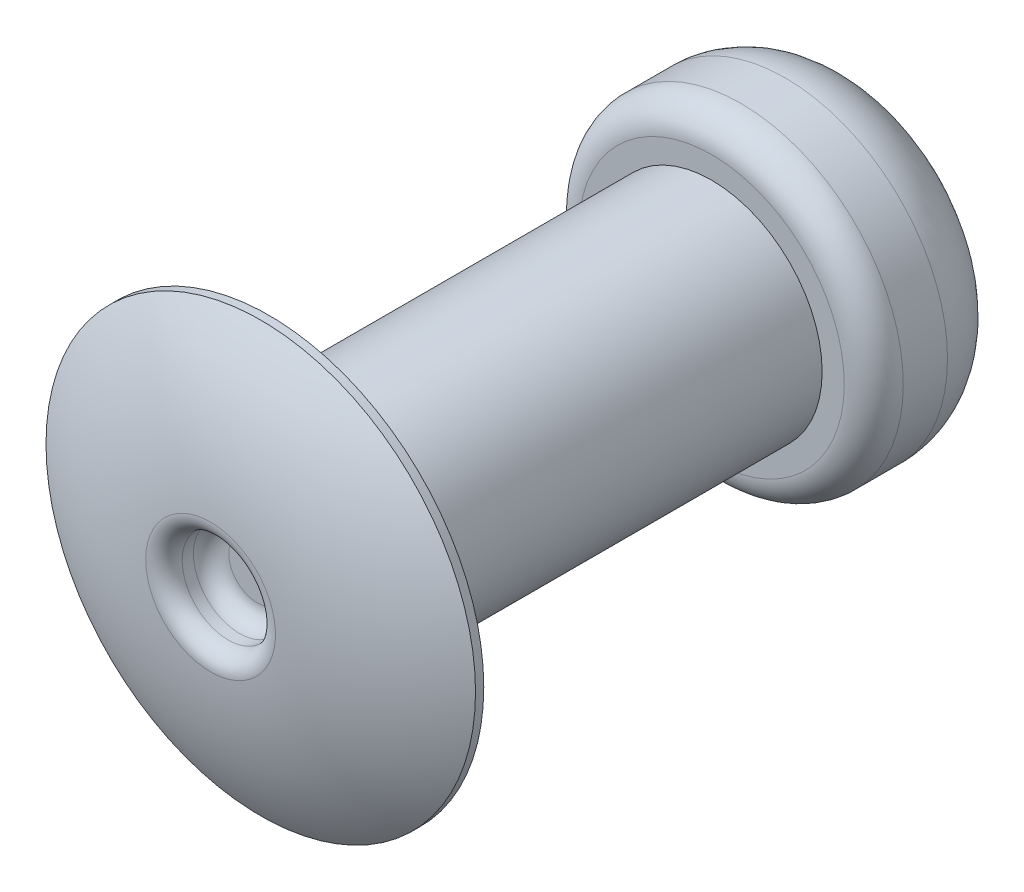
ISO-10303-21;
HEADER;
FILE_DESCRIPTION(('STEP AP214'),'2;1');
FILE_NAME('part.step','',(''),(''),'','','');
FILE_SCHEMA(('AUTOMOTIVE_DESIGN { 1 0 10303 214 1 1 1 1 }'));
ENDSEC;
DATA;
#1=APPLICATION_CONTEXT('core data for automotive mechanical design processes');
#2=APPLICATION_PROTOCOL_DEFINITION('international standard','automotive_design',2000,#1);
#3=PRODUCT_CONTEXT('',#1,'mechanical');
#4=PRODUCT('Part','Part','',(#3));
#5=PRODUCT_RELATED_PRODUCT_CATEGORY('part','',(#4));
#6=PRODUCT_DEFINITION_FORMATION('','',#4);
#7=PRODUCT_DEFINITION_CONTEXT('part definition',#1,'design');
#8=PRODUCT_DEFINITION('design','',#6,#7);
#9=PRODUCT_DEFINITION_SHAPE('','',#8);
#10=(LENGTH_UNIT() NAMED_UNIT(*) SI_UNIT(.MILLI.,.METRE.));
#11=(NAMED_UNIT(*) PLANE_ANGLE_UNIT() SI_UNIT($,.RADIAN.));
#12=(NAMED_UNIT(*) SI_UNIT($,.STERADIAN.) SOLID_ANGLE_UNIT());
#13=UNCERTAINTY_MEASURE_WITH_UNIT(LENGTH_MEASURE(1.E-05),#10,'distance_accuracy_value','');
#14=(GEOMETRIC_REPRESENTATION_CONTEXT(3) GLOBAL_UNCERTAINTY_ASSIGNED_CONTEXT((#13)) GLOBAL_UNIT_ASSIGNED_CONTEXT((#10,
#11,#12)) REPRESENTATION_CONTEXT('',''));
#15=CARTESIAN_POINT('',(0.,0.,0.));
#16=DIRECTION('',(0.,0.,1.));
#17=DIRECTION('',(1.,0.,0.));
#18=AXIS2_PLACEMENT_3D('',#15,#16,#17);
#19=CARTESIAN_POINT('',(0.,3.4925,-12.7));
#20=DIRECTION('',(0.,0.,-1.));
#21=DIRECTION('',(-1.,0.,0.));
#22=AXIS2_PLACEMENT_3D('',#19,#20,#21);
#23=PLANE('',#22);
#24=CARTESIAN_POINT('',(0.,0.,-12.7));
#25=DIRECTION('',(0.,0.,-1.));
#26=DIRECTION('',(-1.,0.,0.));
#27=AXIS2_PLACEMENT_3D('',#24,#25,#26);
#28=CIRCLE('',#27,1.905);
#29=CARTESIAN_POINT('',(-1.905,0.,-12.7));
#30=VERTEX_POINT('',#29);
#31=EDGE_CURVE('E60',#30,#30,#28,.T.);
#32=ORIENTED_EDGE('',*,*,#31,.T.);
#33=EDGE_LOOP('',(#32));
#34=FACE_BOUND('',#33,.T.);
#35=CARTESIAN_POINT('',(0.,0.,-12.7));
#36=DIRECTION('',(0.,0.,-1.));
#37=DIRECTION('',(-1.,0.,0.));
#38=AXIS2_PLACEMENT_3D('',#35,#36,#37);
#39=CIRCLE('',#38,0.992187500000002);
#40=CARTESIAN_POINT('',(-0.992187500000002,0.,-12.7));
#41=VERTEX_POINT('',#40);
#42=EDGE_CURVE('E103',#41,#41,#39,.T.);
#43=ORIENTED_EDGE('',*,*,#42,.F.);
#44=EDGE_LOOP('',(#43));
#45=FACE_BOUND('',#44,.T.);
#46=ADVANCED_FACE('F42',(#34,#45),#23,.T.);
#47=CARTESIAN_POINT('',(0.,0.,7.60058061624149));
#48=DIRECTION('',(0.,0.,-1.));
#49=DIRECTION('',(-1.,0.,0.));
#50=AXIS2_PLACEMENT_3D('',#47,#48,#49);
#51=CYLINDRICAL_SURFACE('',#50,3.4925);
#52=CARTESIAN_POINT('',(0.,0.,-11.1125));
#53=DIRECTION('',(0.,0.,-1.));
#54=DIRECTION('',(-1.,0.,0.));
#55=AXIS2_PLACEMENT_3D('',#52,#53,#54);
#56=CIRCLE('',#55,3.4925);
#57=CARTESIAN_POINT('',(-3.4925,0.,-11.1125));
#58=VERTEX_POINT('',#57);
#59=EDGE_CURVE('E50',#58,#58,#56,.F.);
#60=ORIENTED_EDGE('',*,*,#59,.T.);
#61=EDGE_LOOP('',(#60));
#62=FACE_BOUND('',#61,.T.);
#63=CARTESIAN_POINT('',(0.,0.,-10.16));
#64=DIRECTION('',(0.,0.,1.));
#65=DIRECTION('',(1.,0.,0.));
#66=AXIS2_PLACEMENT_3D('',#63,#64,#65);
#67=CIRCLE('',#66,3.4925);
#68=CARTESIAN_POINT('',(3.4925,0.,-10.16));
#69=VERTEX_POINT('',#68);
#70=EDGE_CURVE('E55',#69,#69,#67,.F.);
#71=ORIENTED_EDGE('',*,*,#70,.T.);
#72=EDGE_LOOP('',(#71));
#73=FACE_BOUND('',#72,.T.);
#74=ADVANCED_FACE('F121',(#62,#73),#51,.T.);
#75=CARTESIAN_POINT('',(0.,2.38125,-9.525));
#76=DIRECTION('',(0.,0.,1.));
#77=DIRECTION('',(1.,0.,0.));
#78=AXIS2_PLACEMENT_3D('',#75,#76,#77);
#79=PLANE('',#78);
#80=CARTESIAN_POINT('',(0.,0.,-9.525));
#81=DIRECTION('',(0.,0.,1.));
#82=DIRECTION('',(1.,0.,0.));
#83=AXIS2_PLACEMENT_3D('',#80,#81,#82);
#84=CIRCLE('',#83,2.8575);
#85=CARTESIAN_POINT('',(2.8575,0.,-9.525));
#86=VERTEX_POINT('',#85);
#87=EDGE_CURVE('E11',#86,#86,#84,.T.);
#88=ORIENTED_EDGE('',*,*,#87,.T.);
#89=EDGE_LOOP('',(#88));
#90=FACE_BOUND('',#89,.T.);
#91=CARTESIAN_POINT('',(0.,0.,-9.525));
#92=DIRECTION('',(0.,0.,-1.));
#93=DIRECTION('',(-1.,0.,0.));
#94=AXIS2_PLACEMENT_3D('',#91,#92,#93);
#95=CIRCLE('',#94,2.38125);
#96=CARTESIAN_POINT('',(-2.38125,0.,-9.525));
#97=VERTEX_POINT('',#96);
#98=EDGE_CURVE('E90',#97,#97,#95,.T.);
#99=ORIENTED_EDGE('',*,*,#98,.T.);
#100=EDGE_LOOP('',(#99));
#101=FACE_BOUND('',#100,.T.);
#102=ADVANCED_FACE('F127',(#90,#101),#79,.T.);
#103=CARTESIAN_POINT('',(0.,0.,7.60058061624149));
#104=DIRECTION('',(0.,0.,-1.));
#105=DIRECTION('',(-1.,0.,0.));
#106=AXIS2_PLACEMENT_3D('',#103,#104,#105);
#107=CYLINDRICAL_SURFACE('',#106,2.38125);
#108=CARTESIAN_POINT('',(0.,0.,-0.381));
#109=DIRECTION('',(0.,0.,-1.));
#110=DIRECTION('',(-1.,0.,0.));
#111=AXIS2_PLACEMENT_3D('',#108,#109,#110);
#112=CIRCLE('',#111,2.38125);
#113=CARTESIAN_POINT('',(-2.38125,0.,-0.381));
#114=VERTEX_POINT('',#113);
#115=EDGE_CURVE('E70',#114,#114,#112,.T.);
#116=ORIENTED_EDGE('',*,*,#115,.T.);
#117=EDGE_LOOP('',(#116));
#118=FACE_BOUND('',#117,.T.);
#119=ORIENTED_EDGE('',*,*,#98,.F.);
#120=EDGE_LOOP('',(#119));
#121=FACE_BOUND('',#120,.T.);
#122=ADVANCED_FACE('F223',(#118,#121),#107,.T.);
#123=CARTESIAN_POINT('',(0.,2.38125,0.));
#124=DIRECTION('',(0.,0.,-1.));
#125=DIRECTION('',(-1.,0.,0.));
#126=AXIS2_PLACEMENT_3D('',#123,#124,#125);
#127=PLANE('',#126);
#128=CARTESIAN_POINT('',(0.,0.,0.));
#129=DIRECTION('',(0.,0.,-1.));
#130=DIRECTION('',(-1.,0.,0.));
#131=AXIS2_PLACEMENT_3D('',#128,#129,#130);
#132=CIRCLE('',#131,2.76225);
#133=CARTESIAN_POINT('',(-2.76225,0.,0.));
#134=VERTEX_POINT('',#133);
#135=EDGE_CURVE('E66',#134,#134,#132,.F.);
#136=ORIENTED_EDGE('',*,*,#135,.T.);
#137=EDGE_LOOP('',(#136));
#138=FACE_BOUND('',#137,.T.);
#139=CARTESIAN_POINT('',(0.,0.,0.));
#140=DIRECTION('',(0.,0.,-1.));
#141=DIRECTION('',(-1.,0.,0.));
#142=AXIS2_PLACEMENT_3D('',#139,#140,#141);
#143=CIRCLE('',#142,4.6228);
#144=CARTESIAN_POINT('',(-4.6228,0.,0.));
#145=VERTEX_POINT('',#144);
#146=EDGE_CURVE('E94',#145,#145,#143,.T.);
#147=ORIENTED_EDGE('',*,*,#146,.T.);
#148=EDGE_LOOP('',(#147));
#149=FACE_BOUND('',#148,.T.);
#150=ADVANCED_FACE('F218',(#138,#149),#127,.T.);
#151=CARTESIAN_POINT('',(0.,0.,7.60058061624149));
#152=DIRECTION('',(0.,0.,-1.));
#153=DIRECTION('',(-1.,0.,0.));
#154=AXIS2_PLACEMENT_3D('',#151,#152,#153);
#155=CYLINDRICAL_SURFACE('',#154,4.6228);
#156=CARTESIAN_POINT('',(0.,0.,0.177799999999999));
#157=DIRECTION('',(0.,0.,-1.));
#158=DIRECTION('',(-1.,0.,0.));
#159=AXIS2_PLACEMENT_3D('',#156,#157,#158);
#160=CIRCLE('',#159,4.6228);
#161=CARTESIAN_POINT('',(-4.6228,0.,0.177799999999999));
#162=VERTEX_POINT('',#161);
#163=EDGE_CURVE('E98',#162,#162,#160,.T.);
#164=ORIENTED_EDGE('',*,*,#163,.T.);
#165=EDGE_LOOP('',(#164));
#166=FACE_BOUND('',#165,.T.);
#167=ORIENTED_EDGE('',*,*,#146,.F.);
#168=EDGE_LOOP('',(#167));
#169=FACE_BOUND('',#168,.T.);
#170=ADVANCED_FACE('F210',(#166,#169),#155,.T.);
#171=CARTESIAN_POINT('',(0.,0.,-5.31041016533429));
#172=DIRECTION('',(0.,0.,-1.));
#173=DIRECTION('',(-1.,0.,0.));
#174=AXIS2_PLACEMENT_3D('',#171,#172,#173);
#175=DEGENERATE_TOROIDAL_SURFACE('',#174,0.992187500000001,6.58041016533429,.T.);
#176=CARTESIAN_POINT('',(0.,0.,1.25756107512751));
#177=DIRECTION('',(0.,0.,-1.));
#178=DIRECTION('',(-1.,0.,0.));
#179=AXIS2_PLACEMENT_3D('',#176,#177,#178);
#180=CIRCLE('',#179,1.39660279212113);
#181=CARTESIAN_POINT('',(-1.39660279212113,0.,1.25756107512751));
#182=VERTEX_POINT('',#181);
#183=EDGE_CURVE('E74',#182,#182,#180,.T.);
#184=ORIENTED_EDGE('',*,*,#183,.T.);
#185=EDGE_LOOP('',(#184));
#186=FACE_BOUND('',#185,.T.);
#187=ORIENTED_EDGE('',*,*,#163,.F.);
#188=EDGE_LOOP('',(#187));
#189=FACE_BOUND('',#188,.T.);
#190=ADVANCED_FACE('F200',(#186,#189),#175,.T.);
#191=CARTESIAN_POINT('',(0.,0.,0.254));
#192=DIRECTION('',(0.,0.,1.));
#193=DIRECTION('',(1.,0.,0.));
#194=AXIS2_PLACEMENT_3D('',#191,#192,#193);
#195=CYLINDRICAL_SURFACE('',#194,0.992187500000002);
#196=CARTESIAN_POINT('',(0.,0.,0.635));
#197=DIRECTION('',(0.,0.,1.));
#198=DIRECTION('',(1.,0.,0.));
#199=AXIS2_PLACEMENT_3D('',#196,#197,#198);
#200=CIRCLE('',#199,0.992187500000002);
#201=CARTESIAN_POINT('',(0.992187500000002,0.,0.635));
#202=VERTEX_POINT('',#201);
#203=EDGE_CURVE('E78',#202,#202,#200,.F.);
#204=ORIENTED_EDGE('',*,*,#203,.T.);
#205=EDGE_LOOP('',(#204));
#206=FACE_BOUND('',#205,.T.);
#207=CARTESIAN_POINT('',(0.,0.,0.87728127801113));
#208=DIRECTION('',(0.,0.,-1.));
#209=DIRECTION('',(-1.,0.,0.));
#210=AXIS2_PLACEMENT_3D('',#207,#208,#209);
#211=CIRCLE('',#210,0.992187500000002);
#212=CARTESIAN_POINT('',(-0.992187500000002,0.,0.87728127801113));
#213=VERTEX_POINT('',#212);
#214=EDGE_CURVE('E82',#213,#213,#211,.F.);
#215=ORIENTED_EDGE('',*,*,#214,.T.);
#216=EDGE_LOOP('',(#215));
#217=FACE_BOUND('',#216,.T.);
#218=ADVANCED_FACE('F189',(#206,#217),#195,.F.);
#219=CARTESIAN_POINT('',(0.,0.,0.254));
#220=DIRECTION('',(0.,0.,1.));
#221=DIRECTION('',(1.,0.,0.));
#222=AXIS2_PLACEMENT_3D('',#219,#220,#221);
#223=PLANE('',#222);
#224=CARTESIAN_POINT('',(0.,0.,0.254));
#225=DIRECTION('',(0.,0.,1.));
#226=DIRECTION('',(1.,0.,0.));
#227=AXIS2_PLACEMENT_3D('',#224,#225,#226);
#228=CIRCLE('',#227,0.611187500000002);
#229=CARTESIAN_POINT('',(0.611187500000002,0.,0.254));
#230=VERTEX_POINT('',#229);
#231=EDGE_CURVE('E86',#230,#230,#228,.T.);
#232=ORIENTED_EDGE('',*,*,#231,.T.);
#233=EDGE_LOOP('',(#232));
#234=FACE_BOUND('',#233,.T.);
#235=ADVANCED_FACE('F116',(#234),#223,.T.);
#236=CARTESIAN_POINT('',(0.,0.,-10.16));
#237=DIRECTION('',(0.,0.,-1.));
#238=DIRECTION('',(-1.,0.,0.));
#239=AXIS2_PLACEMENT_3D('',#236,#237,#238);
#240=CYLINDRICAL_SURFACE('',#239,0.992187500000002);
#241=CARTESIAN_POINT('',(0.,0.,-10.16));
#242=DIRECTION('',(0.,0.,-1.));
#243=DIRECTION('',(-1.,0.,0.));
#244=AXIS2_PLACEMENT_3D('',#241,#242,#243);
#245=CIRCLE('',#244,0.992187500000002);
#246=CARTESIAN_POINT('',(-0.992187500000002,0.,-10.16));
#247=VERTEX_POINT('',#246);
#248=EDGE_CURVE('E102',#247,#247,#245,.T.);
#249=ORIENTED_EDGE('',*,*,#248,.F.);
#250=EDGE_LOOP('',(#249));
#251=FACE_BOUND('',#250,.T.);
#252=ORIENTED_EDGE('',*,*,#42,.T.);
#253=EDGE_LOOP('',(#252));
#254=FACE_BOUND('',#253,.T.);
#255=ADVANCED_FACE('F113',(#251,#254),#240,.F.);
#256=CARTESIAN_POINT('',(0.,0.,-10.16));
#257=DIRECTION('',(0.,0.,-1.));
#258=DIRECTION('',(-1.,0.,0.));
#259=AXIS2_PLACEMENT_3D('',#256,#257,#258);
#260=PLANE('',#259);
#261=ORIENTED_EDGE('',*,*,#248,.T.);
#262=EDGE_LOOP('',(#261));
#263=FACE_BOUND('',#262,.T.);
#264=ADVANCED_FACE('F111',(#263),#260,.T.);
#265=CARTESIAN_POINT('',(0.,0.,0.635));
#266=DIRECTION('',(0.,0.,1.));
#267=DIRECTION('',(1.,0.,0.));
#268=AXIS2_PLACEMENT_3D('',#265,#266,#267);
#269=TOROIDAL_SURFACE('',#268,0.611187500000002,0.381);
#270=ORIENTED_EDGE('',*,*,#203,.F.);
#271=EDGE_LOOP('',(#270));
#272=FACE_BOUND('',#271,.T.);
#273=ORIENTED_EDGE('',*,*,#231,.F.);
#274=EDGE_LOOP('',(#273));
#275=FACE_BOUND('',#274,.T.);
#276=ADVANCED_FACE('F131',(#272,#275),#269,.F.);
#277=CARTESIAN_POINT('',(0.,0.,0.87728127801113));
#278=DIRECTION('',(0.,0.,-1.));
#279=DIRECTION('',(-1.,0.,0.));
#280=AXIS2_PLACEMENT_3D('',#277,#278,#279);
#281=TOROIDAL_SURFACE('',#280,1.3731875,0.381);
#282=ORIENTED_EDGE('',*,*,#183,.F.);
#283=EDGE_LOOP('',(#282));
#284=FACE_BOUND('',#283,.T.);
#285=ORIENTED_EDGE('',*,*,#214,.F.);
#286=EDGE_LOOP('',(#285));
#287=FACE_BOUND('',#286,.T.);
#288=ADVANCED_FACE('F134',(#284,#287),#281,.T.);
#289=CARTESIAN_POINT('',(0.,0.,-0.381));
#290=DIRECTION('',(0.,0.,-1.));
#291=DIRECTION('',(-1.,0.,0.));
#292=AXIS2_PLACEMENT_3D('',#289,#290,#291);
#293=TOROIDAL_SURFACE('',#292,2.76225,0.381);
#294=ORIENTED_EDGE('',*,*,#135,.F.);
#295=EDGE_LOOP('',(#294));
#296=FACE_BOUND('',#295,.T.);
#297=ORIENTED_EDGE('',*,*,#115,.F.);
#298=EDGE_LOOP('',(#297));
#299=FACE_BOUND('',#298,.T.);
#300=ADVANCED_FACE('F138',(#296,#299),#293,.F.);
#301=CARTESIAN_POINT('',(0.,0.,-11.1125));
#302=DIRECTION('',(0.,0.,-1.));
#303=DIRECTION('',(-1.,0.,0.));
#304=AXIS2_PLACEMENT_3D('',#301,#302,#303);
#305=TOROIDAL_SURFACE('',#304,1.905,1.5875);
#306=ORIENTED_EDGE('',*,*,#59,.F.);
#307=EDGE_LOOP('',(#306));
#308=FACE_BOUND('',#307,.T.);
#309=ORIENTED_EDGE('',*,*,#31,.F.);
#310=EDGE_LOOP('',(#309));
#311=FACE_BOUND('',#310,.T.);
#312=ADVANCED_FACE('F141',(#308,#311),#305,.T.);
#313=CARTESIAN_POINT('',(0.,0.,-10.16));
#314=DIRECTION('',(0.,0.,1.));
#315=DIRECTION('',(1.,0.,0.));
#316=AXIS2_PLACEMENT_3D('',#313,#314,#315);
#317=TOROIDAL_SURFACE('',#316,2.8575,0.635);
#318=ORIENTED_EDGE('',*,*,#87,.F.);
#319=EDGE_LOOP('',(#318));
#320=FACE_BOUND('',#319,.T.);
#321=ORIENTED_EDGE('',*,*,#70,.F.);
#322=EDGE_LOOP('',(#321));
#323=FACE_BOUND('',#322,.T.);
#324=ADVANCED_FACE('F44',(#320,#323),#317,.T.);
#325=CLOSED_SHELL('',(#46,#74,#102,#122,#150,#170,#190,#218,#235,#255,#264,#276,#288,#300,#312,#324));
#326=MANIFOLD_SOLID_BREP('B2',#325);
#327=ADVANCED_BREP_SHAPE_REPRESENTATION('',(#18,#326),#14);
#328=SHAPE_DEFINITION_REPRESENTATION(#9,#327);
ENDSEC;
END-ISO-10303-21;
